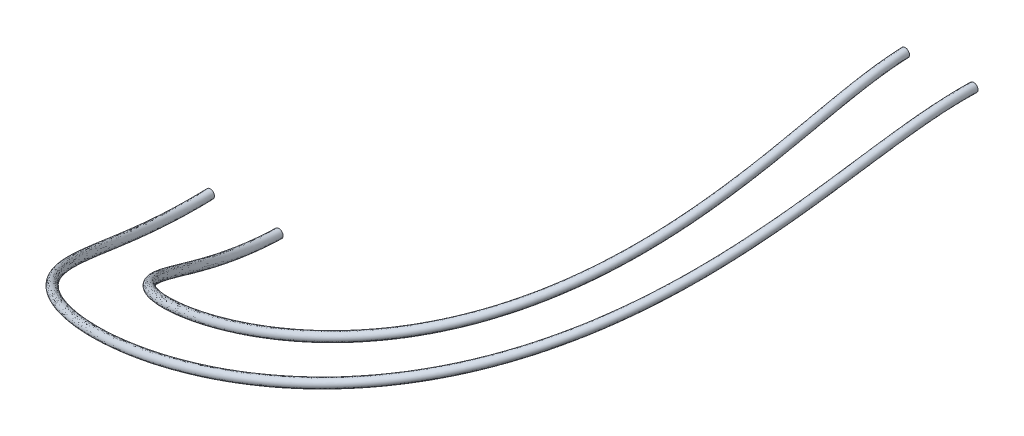
ISO-10303-21;
HEADER;
FILE_DESCRIPTION(('STEP AP214'),'2;1');
FILE_NAME('part.step','',(''),(''),'','','');
FILE_SCHEMA(('AUTOMOTIVE_DESIGN { 1 0 10303 214 1 1 1 1 }'));
ENDSEC;
DATA;
#1=APPLICATION_CONTEXT('core data for automotive mechanical design processes');
#2=APPLICATION_PROTOCOL_DEFINITION('international standard','automotive_design',2000,#1);
#3=PRODUCT_CONTEXT('',#1,'mechanical');
#4=PRODUCT('Part','Part','',(#3));
#5=PRODUCT_RELATED_PRODUCT_CATEGORY('part','',(#4));
#6=PRODUCT_DEFINITION_FORMATION('','',#4);
#7=PRODUCT_DEFINITION_CONTEXT('part definition',#1,'design');
#8=PRODUCT_DEFINITION('design','',#6,#7);
#9=PRODUCT_DEFINITION_SHAPE('','',#8);
#10=(LENGTH_UNIT() NAMED_UNIT(*) SI_UNIT(.MILLI.,.METRE.));
#11=(NAMED_UNIT(*) PLANE_ANGLE_UNIT() SI_UNIT($,.RADIAN.));
#12=(NAMED_UNIT(*) SI_UNIT($,.STERADIAN.) SOLID_ANGLE_UNIT());
#13=UNCERTAINTY_MEASURE_WITH_UNIT(LENGTH_MEASURE(1.E-05),#10,'distance_accuracy_value','');
#14=(GEOMETRIC_REPRESENTATION_CONTEXT(3) GLOBAL_UNCERTAINTY_ASSIGNED_CONTEXT((#13)) GLOBAL_UNIT_ASSIGNED_CONTEXT((#10,
#11,#12)) REPRESENTATION_CONTEXT('',''));
#15=CARTESIAN_POINT('',(0.,0.,0.));
#16=DIRECTION('',(0.,0.,1.));
#17=DIRECTION('',(1.,0.,0.));
#18=AXIS2_PLACEMENT_3D('',#15,#16,#17);
#19=CARTESIAN_POINT('',(-4.,0.,0.));
#20=DIRECTION('',(0.,0.,1.));
#21=DIRECTION('',(1.,0.,0.));
#22=AXIS2_PLACEMENT_3D('',#19,#20,#21);
#23=PLANE('',#22);
#24=CARTESIAN_POINT('',(-4.,0.,0.));
#25=DIRECTION('',(0.,0.,1.));
#26=DIRECTION('',(1.,0.,0.));
#27=AXIS2_PLACEMENT_3D('',#24,#25,#26);
#28=CIRCLE('',#27,0.499999999999999);
#29=CARTESIAN_POINT('',(-3.5,0.,0.));
#30=VERTEX_POINT('',#29);
#31=EDGE_CURVE('E50',#30,#30,#28,.T.);
#32=ORIENTED_EDGE('',*,*,#31,.F.);
#33=EDGE_LOOP('',(#32));
#34=FACE_BOUND('',#33,.T.);
#35=ADVANCED_FACE('F43',(#34),#23,.F.);
#36=CARTESIAN_POINT('',(84.9931572053057,55.2338707628478,0.));
#37=DIRECTION('',(0.,0.,-1.));
#38=DIRECTION('',(-0.998289301326429,-0.0584676907119732,0.));
#39=AXIS2_PLACEMENT_3D('',#36,#37,#38);
#40=PLANE('',#39);
#41=CARTESIAN_POINT('',(84.9931572053057,55.2338707628478,0.));
#42=DIRECTION('',(0.,0.,-1.));
#43=DIRECTION('',(-0.998289301326429,-0.0584676907119732,0.));
#44=AXIS2_PLACEMENT_3D('',#41,#42,#43);
#45=CIRCLE('',#44,0.499999999999999);
#46=CARTESIAN_POINT('',(84.4940125546425,55.2046369174919,0.));
#47=VERTEX_POINT('',#46);
#48=EDGE_CURVE('E12',#47,#47,#45,.T.);
#49=ORIENTED_EDGE('',*,*,#48,.T.);
#50=EDGE_LOOP('',(#49));
#51=FACE_BOUND('',#50,.T.);
#52=ADVANCED_FACE('F57',(#51),#40,.T.);
#53=CARTESIAN_POINT('',(-3.5,0.,0.));
#54=CARTESIAN_POINT('',(-3.49999999960306,-0.0852666043593175,3.20354830547784));
#55=CARTESIAN_POINT('',(-3.14608578982237,0.456625685051473,6.32676211554279));
#56=CARTESIAN_POINT('',(-1.86526629638429,2.27619943484814,12.2527135788759));
#57=CARTESIAN_POINT('',(-0.964403903380054,3.49455464503192,14.9814927504767));
#58=CARTESIAN_POINT('',(1.28618136189157,6.11904635921444,20.1520411026224));
#59=CARTESIAN_POINT('',(2.64748717350486,7.53763644035619,22.5980646617234));
#60=CARTESIAN_POINT('',(5.75447247111704,10.3193784854048,27.1346753180361));
#61=CARTESIAN_POINT('',(7.5131456786479,11.7015238533345,29.2520049731368));
#62=CARTESIAN_POINT('',(11.4804383604942,14.3976308293845,33.1915931376013));
#63=CARTESIAN_POINT('',(13.6908899277374,15.7082031691613,35.0045237855368));
#64=CARTESIAN_POINT('',(18.4096089806881,18.1600679895695,38.1581087427702));
#65=CARTESIAN_POINT('',(20.9318817457448,19.3140080568053,39.5164761204136));
#66=CARTESIAN_POINT('',(26.3161822760704,21.5362955605888,41.7525243335477));
#67=CARTESIAN_POINT('',(29.1698566910031,22.5985411340291,42.6172663898972));
#68=CARTESIAN_POINT('',(34.9419373731698,24.6235788623491,43.7460892807911));
#69=CARTESIAN_POINT('',(37.8810108547779,25.5966263706125,44.0225968492624));
#70=CARTESIAN_POINT('',(43.8394260301558,27.5774567093647,43.9739235405984));
#71=CARTESIAN_POINT('',(46.8091750914019,28.5688556144285,43.6439677265944));
#72=CARTESIAN_POINT('',(52.5507205104943,30.6129472382571,42.4191672510293));
#73=CARTESIAN_POINT('',(55.3496298601686,31.6759704437518,41.5213386677893));
#74=CARTESIAN_POINT('',(60.7115080693986,33.9598668739049,39.1920766245331));
#75=CARTESIAN_POINT('',(63.2104256610736,35.1515237588691,37.7910920907286));
#76=CARTESIAN_POINT('',(67.8500737242992,37.6925875831754,34.5812811167928));
#77=CARTESIAN_POINT('',(70.0052900821006,39.0548060409907,32.7558254811207));
#78=CARTESIAN_POINT('',(73.8636609315842,41.8921894830693,28.8141710977475));
#79=CARTESIAN_POINT('',(75.5653054341556,43.3617554720348,26.7089570506839));
#80=CARTESIAN_POINT('',(78.5566394553984,46.3643263233496,22.2354577611879));
#81=CARTESIAN_POINT('',(79.8554595126248,47.9147417391608,19.8472901688212));
#82=CARTESIAN_POINT('',(82.0017363824807,50.8607387506673,14.834942657744));
#83=CARTESIAN_POINT('',(82.871530894652,52.2935246605702,12.1758165154445));
#84=CARTESIAN_POINT('',(83.8067946248465,53.9687819445732,7.84406206386353));
#85=CARTESIAN_POINT('',(84.0541715612514,54.439163461004,6.35122654450919));
#86=CARTESIAN_POINT('',(84.3977119178899,55.0822082783358,3.2407445355897));
#87=CARTESIAN_POINT('',(84.4915198833983,55.2471972861526,1.62136825458537));
#88=CARTESIAN_POINT('',(84.4940125546425,55.2046369174918,0.));
#89=CARTESIAN_POINT('',(-3.5,0.999999999999998,0.));
#90=CARTESIAN_POINT('',(-3.52436188718587,0.914733395453416,3.07409289425545));
#91=CARTESIAN_POINT('',(-3.20987606275515,1.42961607676719,6.09171629850952));
#92=CARTESIAN_POINT('',(-2.00597132366461,3.20130360311458,11.891589358456));
#93=CARTESIAN_POINT('',(-1.14274127566604,4.39885907260623,14.5923121785157));
#94=CARTESIAN_POINT('',(1.04853502416881,7.00320339940145,19.7485280822413));
#95=CARTESIAN_POINT('',(2.38359254129955,8.41639236322336,22.1996362208435));
#96=CARTESIAN_POINT('',(5.45259807895169,11.199317295012,26.7670109126959));
#97=CARTESIAN_POINT('',(7.19591135209459,12.5844430056154,28.9047909573966));
#98=CARTESIAN_POINT('',(11.1442291732613,15.2916466948463,32.8942037737271));
#99=CARTESIAN_POINT('',(13.3483558982451,16.6082961936529,34.73374340032));
#100=CARTESIAN_POINT('',(18.0624824827251,19.0732959870631,37.9428487715384));
#101=CARTESIAN_POINT('',(20.5841008723534,20.2329630995529,39.3285169712477));
#102=CARTESIAN_POINT('',(25.971400582289,22.4657766523926,41.6185503420842));
#103=CARTESIAN_POINT('',(28.8266544988249,23.5318888581059,42.5090321292503));
#104=CARTESIAN_POINT('',(34.6017183953094,25.562474756739,43.6880727145117));
#105=CARTESIAN_POINT('',(37.5409775431659,26.5367476427261,43.9887648002152));
#106=CARTESIAN_POINT('',(43.4971042595876,28.517237953193,43.9888327891551));
#107=CARTESIAN_POINT('',(46.4642688096571,29.5070306752934,43.6833754913193));
#108=CARTESIAN_POINT('',(52.1982713286301,31.5447269771294,42.5100069596555));
#109=CARTESIAN_POINT('',(54.9929812954372,32.6032463970775,41.6388971018637));
#110=CARTESIAN_POINT('',(60.3465858787826,34.8749168189137,39.3663587793991));
#111=CARTESIAN_POINT('',(62.8430889869222,36.0596143846992,37.994583269667));
#112=CARTESIAN_POINT('',(67.4813211319241,38.584462310002,34.8450129263088));
#113=CARTESIAN_POINT('',(69.6396079822272,39.9386523904354,33.049097870778));
#114=CARTESIAN_POINT('',(73.5102733317813,42.760101097825,29.1645467500104));
#115=CARTESIAN_POINT('',(75.2237470052125,44.2238947011512,27.0841099112476));
#116=CARTESIAN_POINT('',(78.245696453419,47.2188125490871,22.6524153287791));
#117=CARTESIAN_POINT('',(79.5670796788767,48.7715748765746,20.2755399199565));
#118=CARTESIAN_POINT('',(81.7651153417063,51.7320700002247,15.26565852487));
#119=CARTESIAN_POINT('',(82.6700695608569,53.1862657525964,12.5859671111854));
#120=CARTESIAN_POINT('',(83.6615730777604,54.9054409665924,8.16504448372457));
#121=CARTESIAN_POINT('',(83.9292199215955,55.3941329362921,6.62815008228552));
#122=CARTESIAN_POINT('',(84.3102912912648,56.0682971416677,3.39647622612838));
#123=CARTESIAN_POINT('',(84.4208920867413,56.2447743955561,1.70434168051098));
#124=CARTESIAN_POINT('',(84.4355448639305,56.2029262188183,0.));
#125=CARTESIAN_POINT('',(-4.5,0.999999999999998,0.));
#126=CARTESIAN_POINT('',(-4.52436188719996,0.89037150793921,3.14643133206991));
#127=CARTESIAN_POINT('',(-4.20022588425589,1.39639079548639,6.24390985646462));
#128=CARTESIAN_POINT('',(-2.96465305830568,3.16369021436948,12.1824058184377));
#129=CARTESIAN_POINT('',(-2.07917374985641,4.36553970671067,14.947085388463));
#130=CARTESIAN_POINT('',(0.163084341675008,6.97752246247628,20.2167133935194));
#131=CARTESIAN_POINT('',(1.5288497229673,8.39657126526582,22.7217713097565));
#132=CARTESIAN_POINT('',(4.66612254667263,11.1888721560879,27.387454609041));
#133=CARTESIAN_POINT('',(6.44801812083772,12.5786744806578,29.5714519101413));
#134=CARTESIAN_POINT('',(10.483809832563,15.2946804102549,33.6476302198736));
#135=CARTESIAN_POINT('',(12.7363925341692,16.6150880200745,35.5271733622106));
#136=CARTESIAN_POINT('',(17.5563189685909,19.0856923648035,38.8075575544594));
#137=CARTESIAN_POINT('',(20.134080008089,20.2466568321885,40.223907339497));
#138=CARTESIAN_POINT('',(25.6440240639698,22.4817094802038,42.5656516499268));
#139=CARTESIAN_POINT('',(28.5632540689177,23.5476259034081,43.4759642742323));
#140=CARTESIAN_POINT('',(34.4710829632439,25.5769972957986,44.6817068390126));
#141=CARTESIAN_POINT('',(37.4770198803065,26.5495188160736,44.9889683902004));
#142=CARTESIAN_POINT('',(43.5696675878465,28.5277205451916,44.9884754944936));
#143=CARTESIAN_POINT('',(46.6041772326358,29.5161387428665,44.6757784517591));
#144=CARTESIAN_POINT('',(52.4697774126837,31.5527252056654,43.4747563893061));
#145=CARTESIAN_POINT('',(55.3278207277143,32.6112165426273,42.5834212756549));
#146=CARTESIAN_POINT('',(60.801966846192,34.8854221364143,40.2590091692203));
#147=CARTESIAN_POINT('',(63.3544398135412,36.0721606086459,38.8561437013715));
#148=CARTESIAN_POINT('',(68.0960050993779,38.6034357521882,35.6360420241561));
#149=CARTESIAN_POINT('',(70.3014264760352,39.9619393303009,33.8007886907058));
#150=CARTESIAN_POINT('',(74.2565994709869,42.7934057493027,29.831984565656));
#151=CARTESIAN_POINT('',(76.007308180254,44.2627505194182,27.7068736958575));
#152=CARTESIAN_POINT('',(79.0948551165638,47.2691596569955,23.1812889732042));
#153=CARTESIAN_POINT('',(80.4456380326144,48.8291509373556,20.7534016668484));
#154=CARTESIAN_POINT('',(82.6932382901371,51.8016755319922,15.6361643368293));
#155=CARTESIAN_POINT('',(83.6204820657404,53.2639805836731,12.8954713438243));
#156=CARTESIAN_POINT('',(84.6374524936175,54.9876585568772,8.37041904820339));
#157=CARTESIAN_POINT('',(84.9125758534731,55.4770667117972,6.79507336826764));
#158=CARTESIAN_POINT('',(85.3045652947749,56.14566469888,3.48111470470486));
#159=CARTESIAN_POINT('',(85.4184691964109,56.3154021920545,1.74646561051096));
#160=CARTESIAN_POINT('',(85.433834165257,56.2613939095303,-1.22987760935442E-13));
#161=CARTESIAN_POINT('',(-4.5,0.,0.));
#162=CARTESIAN_POINT('',(-4.49999999961715,-0.109628491873523,3.2758867432923));
#163=CARTESIAN_POINT('',(-4.13643561132374,0.423400403770673,6.47895567349788));
#164=CARTESIAN_POINT('',(-2.82394803102473,2.23858604610304,12.5435300388576));
#165=CARTESIAN_POINT('',(-1.90083637757106,3.46123527913635,15.336265960424));
#166=CARTESIAN_POINT('',(0.400730679398401,6.09336542228928,20.6202264139005));
#167=CARTESIAN_POINT('',(1.79274435517324,7.5178153423974,23.1201997506363));
#168=CARTESIAN_POINT('',(4.96799693883736,10.3089333464819,27.7551190143812));
#169=CARTESIAN_POINT('',(6.76525244739102,11.6957553283769,29.9186659258841));
#170=CARTESIAN_POINT('',(10.8200190197959,14.4006645447931,33.9450195837453));
#171=CARTESIAN_POINT('',(13.0789265636616,15.7149949955829,35.7979537474224));
#172=CARTESIAN_POINT('',(17.9034454665539,18.1724643673099,39.0228175256962));
#173=CARTESIAN_POINT('',(20.4818608814805,19.3277017894409,40.411866488668));
#174=CARTESIAN_POINT('',(25.9888057577511,21.5522283883999,42.6996256413853));
#175=CARTESIAN_POINT('',(28.906456261096,22.6142781793288,43.5841985348791));
#176=CARTESIAN_POINT('',(34.8113019411044,24.6381014014113,44.739723405292));
#177=CARTESIAN_POINT('',(37.8170531919185,25.60939754396,45.0228004392476));
#178=CARTESIAN_POINT('',(43.9119893584147,27.5879393013633,44.973566245937));
#179=CARTESIAN_POINT('',(46.9490835143806,28.5779636820016,44.6363706870342));
#180=CARTESIAN_POINT('',(52.8222265945479,30.620945466793,43.38391668068));
#181=CARTESIAN_POINT('',(55.6844692924507,31.6839405892965,42.4658628415805));
#182=CARTESIAN_POINT('',(61.1668890368029,33.9703721914106,40.0847270143543));
#183=CARTESIAN_POINT('',(63.7217764876925,35.1640699828109,38.652652522433));
#184=CARTESIAN_POINT('',(68.464757691753,37.7115610253666,35.3723102146402));
#185=CARTESIAN_POINT('',(70.6671085759288,39.0780929808511,33.5075163010485));
#186=CARTESIAN_POINT('',(74.6099870707695,41.925494134552,29.4816089133931));
#187=CARTESIAN_POINT('',(76.3488666092072,43.4006112903018,27.3317208352964));
#188=CARTESIAN_POINT('',(79.4057981185331,46.414673431258,22.7643314056106));
#189=CARTESIAN_POINT('',(80.7340178663625,47.9723177999418,20.3251519157106));
#190=CARTESIAN_POINT('',(82.9298593309115,50.9303442824348,15.2054484697059));
#191=CARTESIAN_POINT('',(83.8219433995355,52.3712394916469,12.4853207480834));
#192=CARTESIAN_POINT('',(84.7826740407036,54.050999534858,8.04943662834236));
#193=CARTESIAN_POINT('',(85.037527493129,54.5220972365091,6.51814983049131));
#194=CARTESIAN_POINT('',(85.3919859214,55.159575835548,3.32538301416619));
#195=CARTESIAN_POINT('',(85.4890969930679,55.317825082651,1.66349218458535));
#196=CARTESIAN_POINT('',(85.4923018559689,55.2631046082038,-1.10986740156529E-13));
#197=CARTESIAN_POINT('',(-4.5,-0.999999999999998,0.));
#198=CARTESIAN_POINT('',(-4.47563811203433,-1.10962849168626,3.40534215451469));
#199=CARTESIAN_POINT('',(-4.0726453383916,-0.549589987945041,6.71400149053115));
#200=CARTESIAN_POINT('',(-2.68324300374378,1.3134818778366,12.9046542592775));
#201=CARTESIAN_POINT('',(-1.7224990052857,2.55693085156204,15.7254465323851));
#202=CARTESIAN_POINT('',(0.638377017121793,5.20920838210228,21.0237394342817));
#203=CARTESIAN_POINT('',(2.05663898737917,6.63905941952897,23.5186281915161));
#204=CARTESIAN_POINT('',(5.26987133100209,9.42899453687593,28.1227834197214));
#205=CARTESIAN_POINT('',(7.08248677394433,10.812836176096,30.2658799416268));
#206=CARTESIAN_POINT('',(11.1562282070288,13.5066486793313,34.2424089476171));
#207=CARTESIAN_POINT('',(13.4214605931539,14.8149019710914,36.0687341326341));
#208=CARTESIAN_POINT('',(18.2505719645169,17.2592363698163,39.238077496933));
#209=CARTESIAN_POINT('',(20.829641754872,18.4087467466933,40.5998256378389));
#210=CARTESIAN_POINT('',(26.3335874515325,20.6227472965961,42.8335996328437));
#211=CARTESIAN_POINT('',(29.2496584532742,21.6809304552495,43.6924327955259));
#212=CARTESIAN_POINT('',(35.1515209189649,23.6992055070239,44.7977399715715));
#213=CARTESIAN_POINT('',(38.1570865035306,24.6692762718465,45.0566324882949));
#214=CARTESIAN_POINT('',(44.254311128983,26.648158057535,44.9586569973804));
#215=CARTESIAN_POINT('',(47.2939897961254,27.6397886211367,44.5969629223093));
#216=CARTESIAN_POINT('',(53.1746757764121,29.6891657279207,43.2930769720538));
#217=CARTESIAN_POINT('',(56.0411178571872,30.7566646359657,42.348304407506));
#218=CARTESIAN_POINT('',(61.5318112274139,33.0553222464068,39.9104448594882));
#219=CARTESIAN_POINT('',(64.0891131618439,34.2559793569759,38.4491613434945));
#220=CARTESIAN_POINT('',(68.8335102841282,36.8196862985451,35.1085784051242));
#221=CARTESIAN_POINT('',(71.0327906758225,38.1942466314013,33.2142439113912));
#222=CARTESIAN_POINT('',(74.9633746705522,41.0575825198013,29.1312332611302));
#223=CARTESIAN_POINT('',(76.6904250381604,42.5384720611853,26.9565679747353));
#224=CARTESIAN_POINT('',(79.7167411205025,45.5601872055204,22.3473738380169));
#225=CARTESIAN_POINT('',(81.0223977001107,47.115484662528,19.8969021645727));
#226=CARTESIAN_POINT('',(83.166480371686,50.0590130328774,14.7747326025825));
#227=CARTESIAN_POINT('',(84.0234047333307,51.4784983996207,12.0751701523424));
#228=CARTESIAN_POINT('',(84.9278955877896,53.1143405128388,7.72845420848132));
#229=CARTESIAN_POINT('',(85.1624791327849,53.567127761221,6.24122629271498));
#230=CARTESIAN_POINT('',(85.479406548025,54.1734869722161,3.16965132362751));
#231=CARTESIAN_POINT('',(85.5597247897249,54.3202479732475,1.58051875865974));
#232=CARTESIAN_POINT('',(85.5507695466809,54.2648153068774,0.));
#233=CARTESIAN_POINT('',(-3.5,-0.999999999999998,0.));
#234=CARTESIAN_POINT('',(-3.47563811202025,-1.08526660417205,3.33300371670023));
#235=CARTESIAN_POINT('',(-3.08229551688958,-0.516364706664241,6.56180793257606));
#236=CARTESIAN_POINT('',(-1.72456126910398,1.3510952665817,12.6138377992958));
#237=CARTESIAN_POINT('',(-0.786066531094067,2.5902502174576,15.3706733224378));
#238=CARTESIAN_POINT('',(1.52382769961433,5.23488931902744,20.5555541230036));
#239=CARTESIAN_POINT('',(2.91138180571016,6.65888051748902,22.9964931026032));
#240=CARTESIAN_POINT('',(6.0563468632824,9.43943967579757,27.5023397233762));
#241=CARTESIAN_POINT('',(7.83038000520121,10.8186047010536,29.599218988877));
#242=CARTESIAN_POINT('',(11.8166475477271,13.5036149639227,33.4889825014756));
#243=CARTESIAN_POINT('',(14.0334239572298,14.8081101446698,35.2753041707535));
#244=CARTESIAN_POINT('',(18.756735478651,17.2468399920759,38.373368714002));
#245=CARTESIAN_POINT('',(21.2796626191363,18.3950530140577,39.7044352695795));
#246=CARTESIAN_POINT('',(26.6609639698518,20.606814468785,41.8864983250111));
#247=CARTESIAN_POINT('',(29.5130588831814,21.6651934099523,42.725500650544));
#248=CARTESIAN_POINT('',(35.2821563510303,23.6846829679593,43.8041058470706));
#249=CARTESIAN_POINT('',(38.2210441663899,24.656505098499,44.0564288983096));
#250=CARTESIAN_POINT('',(44.1817478007241,26.6376754655365,43.9590142920418));
#251=CARTESIAN_POINT('',(47.1540813731467,27.6306805535637,43.6045599618695));
#252=CARTESIAN_POINT('',(52.9031696923585,29.6811674993847,42.3283275424032));
#253=CARTESIAN_POINT('',(55.7062784249,30.748694490426,41.4037802337148));
#254=CARTESIAN_POINT('',(61.0764302600146,33.044816928896,39.0177944696671));
#255=CARTESIAN_POINT('',(63.5777623352249,34.2434331330391,37.5876009117901));
#256=CARTESIAN_POINT('',(68.2188263166743,36.8007128563489,34.3175493072768));
#257=CARTESIAN_POINT('',(70.370972181974,38.170959691546,32.4625530914634));
#258=CARTESIAN_POINT('',(74.217048531387,41.0242778683136,28.4637954454846));
#259=CARTESIAN_POINT('',(75.9068638630987,42.4996162429183,26.3338041901203));
#260=CARTESIAN_POINT('',(78.8675824573778,45.5098400976121,21.8185001935967));
#261=CARTESIAN_POINT('',(80.143839346373,47.057908601747,19.4190404176859));
#262=CARTESIAN_POINT('',(82.2383574232551,49.9894075011099,14.4042267906181));
#263=CARTESIAN_POINT('',(83.0729922284472,51.400783568544,11.7656659197036));
#264=CARTESIAN_POINT('',(83.9520161719326,53.032122922554,7.5230796440025));
#265=CARTESIAN_POINT('',(84.1791232009073,53.4841939857159,6.07430300673287));
#266=CARTESIAN_POINT('',(84.485132544515,54.0961194150038,3.08501284505102));
#267=CARTESIAN_POINT('',(84.5621476800553,54.2496201767492,1.53839482865976));
#268=CARTESIAN_POINT('',(84.5524802453545,54.2063476161654,0.));
#269=CARTESIAN_POINT('',(-3.5,0.,0.));
#270=CARTESIAN_POINT('',(-3.49999999960306,-0.0852666043593175,3.20354830547784));
#271=CARTESIAN_POINT('',(-3.14608578982237,0.456625685051473,6.32676211554279));
#272=CARTESIAN_POINT('',(-1.86526629638429,2.27619943484814,12.2527135788759));
#273=CARTESIAN_POINT('',(-0.964403903380054,3.49455464503192,14.9814927504767));
#274=CARTESIAN_POINT('',(1.28618136189157,6.11904635921444,20.1520411026224));
#275=CARTESIAN_POINT('',(2.64748717350486,7.53763644035619,22.5980646617234));
#276=CARTESIAN_POINT('',(5.75447247111704,10.3193784854048,27.1346753180361));
#277=CARTESIAN_POINT('',(7.5131456786479,11.7015238533345,29.2520049731368));
#278=CARTESIAN_POINT('',(11.4804383604942,14.3976308293845,33.1915931376013));
#279=CARTESIAN_POINT('',(13.6908899277374,15.7082031691613,35.0045237855368));
#280=CARTESIAN_POINT('',(18.4096089806881,18.1600679895695,38.1581087427702));
#281=CARTESIAN_POINT('',(20.9318817457448,19.3140080568053,39.5164761204136));
#282=CARTESIAN_POINT('',(26.3161822760704,21.5362955605888,41.7525243335477));
#283=CARTESIAN_POINT('',(29.1698566910031,22.5985411340291,42.6172663898972));
#284=CARTESIAN_POINT('',(34.9419373731698,24.6235788623491,43.7460892807911));
#285=CARTESIAN_POINT('',(37.8810108547779,25.5966263706125,44.0225968492624));
#286=CARTESIAN_POINT('',(43.8394260301558,27.5774567093647,43.9739235405984));
#287=CARTESIAN_POINT('',(46.8091750914019,28.5688556144285,43.6439677265944));
#288=CARTESIAN_POINT('',(52.5507205104943,30.6129472382571,42.4191672510293));
#289=CARTESIAN_POINT('',(55.3496298601686,31.6759704437518,41.5213386677893));
#290=CARTESIAN_POINT('',(60.7115080693986,33.9598668739049,39.1920766245331));
#291=CARTESIAN_POINT('',(63.2104256610736,35.1515237588691,37.7910920907286));
#292=CARTESIAN_POINT('',(67.8500737242992,37.6925875831754,34.5812811167928));
#293=CARTESIAN_POINT('',(70.0052900821006,39.0548060409907,32.7558254811207));
#294=CARTESIAN_POINT('',(73.8636609315842,41.8921894830693,28.8141710977475));
#295=CARTESIAN_POINT('',(75.5653054341556,43.3617554720348,26.7089570506839));
#296=CARTESIAN_POINT('',(78.5566394553984,46.3643263233496,22.2354577611879));
#297=CARTESIAN_POINT('',(79.8554595126248,47.9147417391608,19.8472901688212));
#298=CARTESIAN_POINT('',(82.0017363824807,50.8607387506673,14.834942657744));
#299=CARTESIAN_POINT('',(82.871530894652,52.2935246605702,12.1758165154445));
#300=CARTESIAN_POINT('',(83.8067946248465,53.9687819445732,7.84406206386353));
#301=CARTESIAN_POINT('',(84.0541715612514,54.439163461004,6.35122654450919));
#302=CARTESIAN_POINT('',(84.3977119178899,55.0822082783358,3.2407445355897));
#303=CARTESIAN_POINT('',(84.4915198833983,55.2471972861526,1.62136825458537));
#304=CARTESIAN_POINT('',(84.4940125546425,55.2046369174918,0.));
#305=(BOUNDED_SURFACE() B_SPLINE_SURFACE(3,3,((#53,#54,#55,#56,#57,#58,#59,#60,#61,#62,#63,#64,
#65,#66,#67,#68,#69,#70,#71,#72,#73,#74,#75,#76,#77,#78,#79,#80,#81,#82,#83,#84,#85,#86,#87,
#88),(#89,#90,#91,#92,#93,#94,#95,#96,#97,#98,#99,#100,#101,#102,#103,#104,#105,#106,#107,#108,
#109,#110,#111,#112,#113,#114,#115,#116,#117,#118,#119,#120,#121,#122,#123,#124),(#125,#126,
#127,#128,#129,#130,#131,#132,#133,#134,#135,#136,#137,#138,#139,#140,#141,#142,#143,#144,#145,
#146,#147,#148,#149,#150,#151,#152,#153,#154,#155,#156,#157,#158,#159,#160),(#161,#162,#163,
#164,#165,#166,#167,#168,#169,#170,#171,#172,#173,#174,#175,#176,#177,#178,#179,#180,#181,#182,
#183,#184,#185,#186,#187,#188,#189,#190,#191,#192,#193,#194,#195,#196),(#197,#198,#199,#200,
#201,#202,#203,#204,#205,#206,#207,#208,#209,#210,#211,#212,#213,#214,#215,#216,#217,#218,#219,
#220,#221,#222,#223,#224,#225,#226,#227,#228,#229,#230,#231,#232),(#233,#234,#235,#236,#237,
#238,#239,#240,#241,#242,#243,#244,#245,#246,#247,#248,#249,#250,#251,#252,#253,#254,#255,#256,
#257,#258,#259,#260,#261,#262,#263,#264,#265,#266,#267,#268),(#269,#270,#271,#272,#273,#274,
#275,#276,#277,#278,#279,#280,#281,#282,#283,#284,#285,#286,#287,#288,#289,#290,#291,#292,#293,
#294,#295,#296,#297,#298,#299,#300,#301,#302,#303,#304)),.UNSPECIFIED.,.T.,.F.,
.F.) B_SPLINE_SURFACE_WITH_KNOTS((4,3,4),(4,2,2,2,2,2,2,2,2,2,2,2,2,2,2,2,2,4),(0.,0.5,1.),(0.,
0.0625,0.125,0.187499999999915,0.25,0.312499999999966,0.375,0.4375,0.5,0.5625,0.625,
0.687500000000055,0.75,0.81250000000001,0.875,0.9375,0.96875,1.),
.UNSPECIFIED.) GEOMETRIC_REPRESENTATION_ITEM() RATIONAL_B_SPLINE_SURFACE(((1.,1.,1.,1.,1.,1.,1.,
1.,1.,1.,1.,1.,1.,1.,1.,1.,1.,1.,1.,1.,1.,1.,1.,1.,1.,1.,1.,1.,1.,1.,1.,1.,1.,1.,1.,1.),
(0.333333333333333,0.333333333333333,0.333333333333333,0.333333333333333,0.333333333333333,
0.333333333333333,0.333333333333333,0.333333333333333,0.333333333333333,0.333333333333333,
0.333333333333333,0.333333333333333,0.333333333333333,0.333333333333333,0.333333333333333,
0.333333333333333,0.333333333333333,0.333333333333333,0.333333333333333,0.333333333333333,
0.333333333333333,0.333333333333333,0.333333333333333,0.333333333333333,0.333333333333333,
0.333333333333333,0.333333333333333,0.333333333333333,0.333333333333333,0.333333333333333,
0.333333333333333,0.333333333333333,0.333333333333333,0.333333333333333,0.333333333333333,
0.333333333333333),(0.333333333333333,0.333333333333333,0.333333333333333,0.333333333333333,
0.333333333333333,0.333333333333333,0.333333333333333,0.333333333333333,0.333333333333333,
0.333333333333333,0.333333333333333,0.333333333333333,0.333333333333333,0.333333333333333,
0.333333333333333,0.333333333333333,0.333333333333333,0.333333333333333,0.333333333333333,
0.333333333333333,0.333333333333333,0.333333333333333,0.333333333333333,0.333333333333333,
0.333333333333333,0.333333333333333,0.333333333333333,0.333333333333333,0.333333333333333,
0.333333333333333,0.333333333333333,0.333333333333333,0.333333333333333,0.333333333333333,
0.333333333333333,0.333333333333333),(1.,1.,1.,1.,1.,1.,1.,1.,1.,1.,1.,1.,1.,1.,1.,1.,1.,1.,1.,
1.,1.,1.,1.,1.,1.,1.,1.,1.,1.,1.,1.,1.,1.,1.,1.,1.),(0.333333333333333,0.333333333333333,
0.333333333333333,0.333333333333333,0.333333333333333,0.333333333333333,0.333333333333333,
0.333333333333333,0.333333333333333,0.333333333333333,0.333333333333333,0.333333333333333,
0.333333333333333,0.333333333333333,0.333333333333333,0.333333333333333,0.333333333333333,
0.333333333333333,0.333333333333333,0.333333333333333,0.333333333333333,0.333333333333333,
0.333333333333333,0.333333333333333,0.333333333333333,0.333333333333333,0.333333333333333,
0.333333333333333,0.333333333333333,0.333333333333333,0.333333333333333,0.333333333333333,
0.333333333333333,0.333333333333333,0.333333333333333,0.333333333333333),(0.333333333333333,
0.333333333333333,0.333333333333333,0.333333333333333,0.333333333333333,0.333333333333333,
0.333333333333333,0.333333333333333,0.333333333333333,0.333333333333333,0.333333333333333,
0.333333333333333,0.333333333333333,0.333333333333333,0.333333333333333,0.333333333333333,
0.333333333333333,0.333333333333333,0.333333333333333,0.333333333333333,0.333333333333333,
0.333333333333333,0.333333333333333,0.333333333333333,0.333333333333333,0.333333333333333,
0.333333333333333,0.333333333333333,0.333333333333333,0.333333333333333,0.333333333333333,
0.333333333333333,0.333333333333333,0.333333333333333,0.333333333333333,0.333333333333333),(1.,
1.,1.,1.,1.,1.,1.,1.,1.,1.,1.,1.,1.,1.,1.,1.,1.,1.,1.,1.,1.,1.,1.,1.,1.,1.,1.,1.,1.,1.,1.,1.,1.,
1.,1.,1.))) REPRESENTATION_ITEM('') SURFACE());
#306=ORIENTED_EDGE('',*,*,#48,.F.);
#307=EDGE_LOOP('',(#306));
#308=FACE_BOUND('',#307,.T.);
#309=ORIENTED_EDGE('',*,*,#31,.T.);
#310=EDGE_LOOP('',(#309));
#311=FACE_BOUND('',#310,.T.);
#312=ADVANCED_FACE('F59',(#308,#311),#305,.T.);
#313=CLOSED_SHELL('',(#35,#52,#312));
#314=MANIFOLD_SOLID_BREP('B2',#313);
#315=CARTESIAN_POINT('',(4.,0.,0.));
#316=DIRECTION('',(0.,0.,1.));
#317=DIRECTION('',(1.,0.,0.));
#318=AXIS2_PLACEMENT_3D('',#315,#316,#317);
#319=PLANE('',#318);
#320=CARTESIAN_POINT('',(4.,0.,0.));
#321=DIRECTION('',(0.,0.,1.));
#322=DIRECTION('',(1.,0.,0.));
#323=AXIS2_PLACEMENT_3D('',#320,#321,#322);
#324=CIRCLE('',#323,0.499999999999999);
#325=CARTESIAN_POINT('',(4.5,0.,0.));
#326=VERTEX_POINT('',#325);
#327=EDGE_CURVE('E100',#326,#326,#324,.T.);
#328=ORIENTED_EDGE('',*,*,#327,.F.);
#329=EDGE_LOOP('',(#328));
#330=FACE_BOUND('',#329,.T.);
#331=ADVANCED_FACE('F93',(#330),#319,.F.);
#332=CARTESIAN_POINT('',(77.0068427946943,54.7661292371521,1.37868298383803E-13));
#333=DIRECTION('',(0.,0.,-1.));
#334=DIRECTION('',(-0.998289301326429,-0.0584676907119732,0.));
#335=AXIS2_PLACEMENT_3D('',#332,#333,#334);
#336=PLANE('',#335);
#337=CARTESIAN_POINT('',(77.0068427946943,54.7661292371521,1.37868298383803E-13));
#338=DIRECTION('',(0.,0.,-1.));
#339=DIRECTION('',(-0.998289301326429,-0.0584676907119732,0.));
#340=AXIS2_PLACEMENT_3D('',#337,#338,#339);
#341=CIRCLE('',#340,0.499999999999999);
#342=CARTESIAN_POINT('',(76.5076981440311,54.7368953917961,1.52506830062646E-13));
#343=VERTEX_POINT('',#342);
#344=EDGE_CURVE('E41',#343,#343,#341,.T.);
#345=ORIENTED_EDGE('',*,*,#344,.T.);
#346=EDGE_LOOP('',(#345));
#347=FACE_BOUND('',#346,.T.);
#348=ADVANCED_FACE('F107',(#347),#336,.T.);
#349=CARTESIAN_POINT('',(4.5,0.,0.));
#350=CARTESIAN_POINT('',(4.50000000056211,0.109628495754328,2.62484080296213));
#351=CARTESIAN_POINT('',(4.77671278220076,0.722427935296926,5.10921365188172));
#352=CARTESIAN_POINT('',(5.80418758072716,2.57710654480989,9.92618189904279));
#353=CARTESIAN_POINT('',(6.52705589014481,3.76110957219265,12.1433070709182));
#354=CARTESIAN_POINT('',(8.36978682184011,6.32449385461953,16.4065586123774));
#355=CARTESIAN_POINT('',(9.48542972016036,7.69620522403158,18.4209839504));
#356=CARTESIAN_POINT('',(12.046276729352,10.4029395967829,22.1711257472952));
#357=CARTESIAN_POINT('',(13.4962915287029,11.7476720529953,23.9187173511185));
#358=CARTESIAN_POINT('',(16.7637930860806,14.3733611061157,27.1641815684897));
#359=CARTESIAN_POINT('',(18.5865968403344,15.6538685578236,28.6570840904418));
#360=CARTESIAN_POINT('',(22.4589170937716,18.0608969676115,31.2404384793726));
#361=CARTESIAN_POINT('',(24.5320486598343,19.2044581957204,32.3533531743184));
#362=CARTESIAN_POINT('',(28.9351944226498,21.4088329380997,34.175713870907));
#363=CARTESIAN_POINT('',(31.2770601302301,22.4726447716018,34.8818092300415));
#364=CARTESIAN_POINT('',(35.9870208297235,24.5073985498823,35.7970162847842));
#365=CARTESIAN_POINT('',(38.392672157602,25.4944569838174,36.0209681294313));
#366=CARTESIAN_POINT('',(43.2589194041352,27.4935959733913,35.9767818978392));
#367=CARTESIAN_POINT('',(45.6899077076225,28.4959910738492,35.704744043076));
#368=CARTESIAN_POINT('',(50.3786718380155,30.5489614099643,34.701171813824));
#369=CARTESIAN_POINT('',(52.6709144019621,31.6122092793834,33.965145277429));
#370=CARTESIAN_POINT('',(57.0684603301127,33.8758243338694,32.0508735059944));
#371=CARTESIAN_POINT('',(59.119619048172,35.0511539672747,30.8986086371331));
#372=CARTESIAN_POINT('',(62.9326019846184,37.5408000457061,28.2530483339737));
#373=CARTESIAN_POINT('',(64.7107421315759,38.8685105220769,26.7422989217237));
#374=CARTESIAN_POINT('',(67.8930518180004,41.625752271238,23.4746685725575));
#375=CARTESIAN_POINT('',(69.2968160337429,43.0509089259491,21.7268467737993));
#376=CARTESIAN_POINT('',(71.7633701503207,45.9615494600326,18.0044686057915));
#377=CARTESIAN_POINT('',(72.8269926827025,47.4541332529328,16.0243961937062));
#378=CARTESIAN_POINT('',(74.5767527950543,50.3038944965071,11.870896162049));
#379=CARTESIAN_POINT('',(75.2682308556653,51.6718060119368,9.69978265433347));
#380=CARTESIAN_POINT('',(75.9997592979495,53.3110412223049,6.20106554803299));
#381=CARTESIAN_POINT('',(76.1873241062611,53.7756932569632,5.01584025665071));
#382=CARTESIAN_POINT('',(76.4435198897794,54.4632678206378,2.56363670697939));
#383=CARTESIAN_POINT('',(76.5109030061543,54.6821749142682,1.2843768145855));
#384=CARTESIAN_POINT('',(76.5076981440311,54.7368953917961,1.52506830062646E-13));
#385=CARTESIAN_POINT('',(4.5,0.999999999999999,0.));
#386=CARTESIAN_POINT('',(4.4756381129793,1.10962849556706,2.49538539173974));
#387=CARTESIAN_POINT('',(4.71292250926797,1.6954183270128,4.87416783484845));
#388=CARTESIAN_POINT('',(5.66348255344684,3.50221071307617,9.5650576786229));
#389=CARTESIAN_POINT('',(6.34871851785945,4.66541399976633,11.7541264989572));
#390=CARTESIAN_POINT('',(8.13214048411671,7.20865089480717,16.0030455919963));
#391=CARTESIAN_POINT('',(9.22153508795568,8.57496114689875,18.0225555095227));
#392=CARTESIAN_POINT('',(11.744402337186,11.2828784063902,21.8034613419525));
#393=CARTESIAN_POINT('',(13.1790572021496,12.630591205275,23.5715033353808));
#394=CARTESIAN_POINT('',(16.4275838988477,15.2673769715788,26.8667922046129));
#395=CARTESIAN_POINT('',(18.244062810842,16.5539615823126,28.3863037052275));
#396=CARTESIAN_POINT('',(22.1117905958086,18.9741249651076,31.0251785081384));
#397=CARTESIAN_POINT('',(24.1842677864454,20.123413238468,32.1653940251475));
#398=CARTESIAN_POINT('',(28.5904127288659,22.3383140299036,34.0417398794486));
#399=CARTESIAN_POINT('',(30.9338579380518,23.4059924956811,34.7735749693947));
#400=CARTESIAN_POINT('',(35.6468018518631,25.4462944442697,35.7389997185048));
#401=CARTESIAN_POINT('',(38.05263884599,26.4345782559309,35.9871360803841));
#402=CARTESIAN_POINT('',(42.9165976335669,28.4333772172195,35.9916911463959));
#403=CARTESIAN_POINT('',(45.3450014258777,29.4341661347116,35.7441518078009));
#404=CARTESIAN_POINT('',(50.0262226561513,31.4807411488392,34.7920115224501));
#405=CARTESIAN_POINT('',(52.3142658372257,32.5394852327091,34.0827037115034));
#406=CARTESIAN_POINT('',(56.7035381395018,34.7908742788782,32.2251556608604));
#407=CARTESIAN_POINT('',(58.7522823740156,35.9592445931047,31.1020998160716));
#408=CARTESIAN_POINT('',(62.5638493922483,38.4326747725327,28.5167801434897));
#409=CARTESIAN_POINT('',(64.3450600316823,39.7523568715267,27.035571311381));
#410=CARTESIAN_POINT('',(67.5396642182177,42.4936638859887,23.8250442248204));
#411=CARTESIAN_POINT('',(68.9552576047897,43.9130481550655,22.1019996343604));
#412=CARTESIAN_POINT('',(71.4524271483513,46.8160356857701,18.4214261733852));
#413=CARTESIAN_POINT('',(72.5386128489544,48.3109663903467,16.4526459448428));
#414=CARTESIAN_POINT('',(74.3401317542799,51.1752257460645,12.3016120291737));
#415=CARTESIAN_POINT('',(75.0667695218702,52.564547103963,10.109933250075));
#416=CARTESIAN_POINT('',(75.8545377508634,54.2477002443242,6.52204796789371));
#417=CARTESIAN_POINT('',(76.0623724666052,54.7306627322488,5.29276379442688));
#418=CARTESIAN_POINT('',(76.3560992631543,55.4493566839722,2.71936839751823));
#419=CARTESIAN_POINT('',(76.4402752094973,55.6797520236563,1.36735024051111));
#420=CARTESIAN_POINT('',(76.4492304533191,55.7351846931225,1.40505809283732E-13));
#421=CARTESIAN_POINT('',(3.5,0.999999999999999,0.));
#422=CARTESIAN_POINT('',(3.47563811295882,1.08526660805286,2.5677238295542));
#423=CARTESIAN_POINT('',(3.72257268776596,1.66219304573216,5.02636139280481));
#424=CARTESIAN_POINT('',(4.70480081880704,3.46459732433091,9.85587413860332));
#425=CARTESIAN_POINT('',(5.41228604366908,4.63209463387329,12.108899708902));
#426=CARTESIAN_POINT('',(7.24668980162291,7.18296995787948,16.4712309032769));
#427=CARTESIAN_POINT('',(8.36679226962406,8.5551400489387,18.5446905984356));
#428=CARTESIAN_POINT('',(10.9579268049064,11.2724332674685,22.4239050382976));
#429=CARTESIAN_POINT('',(12.431163970894,12.6248226803186,24.238164288128));
#430=CARTESIAN_POINT('',(15.7671645581481,15.2704106869861,27.6202186507569));
#431=CARTESIAN_POINT('',(17.6320994467686,16.5607534087292,29.1797336671182));
#432=CARTESIAN_POINT('',(21.6056270816719,18.986521342853,31.8898872910593));
#433=CARTESIAN_POINT('',(23.7342469221785,20.1371069711011,33.0607843934069));
#434=CARTESIAN_POINT('',(28.2630362105491,22.3542468577172,34.9888411872811));
#435=CARTESIAN_POINT('',(30.6704575081447,23.4217295409858,35.7405071143766));
#436=CARTESIAN_POINT('',(35.5161664197976,25.4608169833268,36.7326338430056));
#437=CARTESIAN_POINT('',(37.9886811831458,26.4473494292809,36.9873396703693));
#438=CARTESIAN_POINT('',(42.9891609618107,28.4438598092156,36.9913338517344));
#439=CARTESIAN_POINT('',(45.4849098488463,29.4432742022846,36.7365547682407));
#440=CARTESIAN_POINT('',(50.2977287402149,31.4887393773752,35.7567609521008));
#441=CARTESIAN_POINT('',(52.6491052694977,32.5474553782589,35.0272278852947));
#442=CARTESIAN_POINT('',(57.1589191069163,34.8013795963789,33.1178060506815));
#443=CARTESIAN_POINT('',(59.2636332006195,35.9717908170566,31.9636602477685));
#444=CARTESIAN_POINT('',(63.1785333597171,38.4516482147138,29.3078092413446));
#445=CARTESIAN_POINT('',(65.0068785255004,39.7756438113972,27.7872621313088));
#446=CARTESIAN_POINT('',(68.2859903574132,42.5269685374613,24.492482040466));
#447=CARTESIAN_POINT('',(69.7388187798413,43.9519039733325,22.7247634189729));
#448=CARTESIAN_POINT('',(72.301585811486,46.8663827936784,18.9502998178079));
#449=CARTESIAN_POINT('',(73.4171712026921,48.3685424511277,16.930507691736));
#450=CARTESIAN_POINT('',(75.2682547027107,51.244831277832,12.6721178411318));
#451=CARTESIAN_POINT('',(76.0171820267537,52.6422619350346,10.4194374827139));
#452=CARTESIAN_POINT('',(76.8304171667205,54.3299178346115,6.72742253237253));
#453=CARTESIAN_POINT('',(77.0457283984828,54.8135965077539,5.45968708040915));
#454=CARTESIAN_POINT('',(77.3503732666643,55.5267242411845,2.80400687609456));
#455=CARTESIAN_POINT('',(77.4378523191669,55.750379820147,1.40947417051109));
#456=CARTESIAN_POINT('',(77.4475197546455,55.7936523838345,1.11228745926046E-13));
#457=CARTESIAN_POINT('',(3.5,0.,0.));
#458=CARTESIAN_POINT('',(3.50000000054163,0.0852666082401228,2.69717924077659));
#459=CARTESIAN_POINT('',(3.78636296069874,0.689202654016126,5.26140720983808));
#460=CARTESIAN_POINT('',(4.84550584608735,2.53949315606479,10.2169983590232));
#461=CARTESIAN_POINT('',(5.59062341595444,3.72779020629835,12.498080280863));
#462=CARTESIAN_POINT('',(7.48433613934631,6.29881291769311,16.874743923658));
#463=CARTESIAN_POINT('',(8.63068690182999,7.67638412607278,18.9431190393129));
#464=CARTESIAN_POINT('',(11.2598011970711,10.39249445786,22.7915694436403));
#465=CARTESIAN_POINT('',(12.7483982974461,11.7419035280377,24.5853783038657));
#466=CARTESIAN_POINT('',(16.1033737453823,14.3763948215243,27.9176080146337));
#467=CARTESIAN_POINT('',(17.974633476261,15.6606603842402,29.4505140523324));
#468=CARTESIAN_POINT('',(21.9527535796349,18.0732933453569,32.1051472622936));
#469=CARTESIAN_POINT('',(24.08202779557,19.218151928356,33.2487435425728));
#470=CARTESIAN_POINT('',(28.6078179043305,21.4247657659109,35.1228151787446));
#471=CARTESIAN_POINT('',(31.013659700323,22.4883818169065,35.8487413750235));
#472=CARTESIAN_POINT('',(35.8563853976581,24.5219210889394,36.7906504092851));
#473=CARTESIAN_POINT('',(38.3287144947528,25.5072281571648,37.0211717194165));
#474=CARTESIAN_POINT('',(43.331482732384,27.5040785653898,36.9764246031778));
#475=CARTESIAN_POINT('',(45.8298161305912,28.5050991414222,36.6971470035158));
#476=CARTESIAN_POINT('',(50.6501779220791,30.5569596385003,35.6659212434746));
#477=CARTESIAN_POINT('',(53.0057538342341,31.6201794249282,34.9096694512202));
#478=CARTESIAN_POINT('',(57.5238412975272,33.8863296513751,32.9435238958155));
#479=CARTESIAN_POINT('',(59.6309698747809,35.0637001912265,31.7601690688325));
#480=CARTESIAN_POINT('',(63.5472859520822,37.5597734878873,29.0440774318261));
#481=CARTESIAN_POINT('',(65.3725606253839,38.8917974619474,27.4939897416515));
#482=CARTESIAN_POINT('',(68.6393779572059,41.6590569227106,24.1421063882031));
#483=CARTESIAN_POINT('',(70.0803772087945,43.0897647442161,22.3496105584117));
#484=CARTESIAN_POINT('',(72.6125288134554,46.0118965679409,18.5333422502142));
#485=CARTESIAN_POINT('',(73.7055510364403,47.5117093137139,16.5022579405981));
#486=CARTESIAN_POINT('',(75.5048757434851,50.3735000282746,12.2414019740084));
#487=CARTESIAN_POINT('',(76.2186433605488,51.7495208430135,10.0092868869723));
#488=CARTESIAN_POINT('',(76.9756387138066,53.3932588125897,6.40644011251181));
#489=CARTESIAN_POINT('',(77.1706800381387,53.8586270324683,5.18276354263313));
#490=CARTESIAN_POINT('',(77.4377938932894,54.54063537785,2.64827518555556));
#491=CARTESIAN_POINT('',(77.5084801158239,54.752802710741,1.32650074458548));
#492=CARTESIAN_POINT('',(77.5059874453575,54.795363082508,1.2322976670496E-13));
#493=CARTESIAN_POINT('',(3.5,-0.999999999999996,0.));
#494=CARTESIAN_POINT('',(3.52436188812444,-0.91473339157261,2.82663465199898));
#495=CARTESIAN_POINT('',(3.85015323363153,-0.283787737699906,5.49645302687135));
#496=CARTESIAN_POINT('',(4.98621087336767,1.61438898779867,10.5781225794431));
#497=CARTESIAN_POINT('',(5.7689607882398,2.8234857787234,12.8872608528241));
#498=CARTESIAN_POINT('',(7.7219824770697,5.41465587750674,17.2782569440392));
#499=CARTESIAN_POINT('',(8.89458153403593,6.79762820320686,19.3415474801902));
#500=CARTESIAN_POINT('',(11.5616755892358,9.51255564825158,23.159233848983));
#501=CARTESIAN_POINT('',(13.0656326239981,10.8589843757568,24.9325923196034));
#502=CARTESIAN_POINT('',(16.4395829326164,13.4823789560625,28.2149973785105));
#503=CARTESIAN_POINT('',(18.3171675057534,14.7605673597511,29.7212944375467));
#504=CARTESIAN_POINT('',(22.2998800775979,17.1600653478608,32.3204072335279));
#505=CARTESIAN_POINT('',(24.4298086689615,18.2991968856109,33.4367026917387));
#506=CARTESIAN_POINT('',(28.9525995981119,20.4952846741045,35.2567891702081));
#507=CARTESIAN_POINT('',(31.3568618925012,21.5550340928271,35.9569756356703));
#508=CARTESIAN_POINT('',(36.1966043755186,23.583025194552,36.8486669755645));
#509=CARTESIAN_POINT('',(38.6687478063597,24.5671068850488,37.0550037684638));
#510=CARTESIAN_POINT('',(43.6738045029573,26.5642973215641,36.9615153546211));
#511=CARTESIAN_POINT('',(46.174722412336,27.5669240805599,36.6577392387909));
#512=CARTESIAN_POINT('',(51.0026271039433,29.6251798996254,35.5750815348485));
#513=CARTESIAN_POINT('',(53.3624023989706,30.6929034715974,34.7921110171458));
#514=CARTESIAN_POINT('',(57.8887634881382,32.9712797063713,32.7692417409495));
#515=CARTESIAN_POINT('',(59.9983065489423,34.1556095653965,31.5566778898966));
#516=CARTESIAN_POINT('',(63.9160385444473,36.6678987610607,28.7803456223076));
#517=CARTESIAN_POINT('',(65.7382427252674,38.0079511124977,27.2007173519942));
#518=CARTESIAN_POINT('',(68.9927655569987,40.7911453079599,23.7917307359401));
#519=CARTESIAN_POINT('',(70.4219356377477,42.2276255150997,21.9744576978506));
#520=CARTESIAN_POINT('',(72.9234718154247,45.1574103422034,18.1163846826205));
#521=CARTESIAN_POINT('',(73.9939308701884,46.6548761763,16.0740081894603));
#522=CARTESIAN_POINT('',(75.7414967842595,49.5021687787172,11.810686106885));
#523=CARTESIAN_POINT('',(76.4201046943439,50.8567797509923,9.59913629123078));
#524=CARTESIAN_POINT('',(77.1208602608926,52.456599790568,6.08545769265109));
#525=CARTESIAN_POINT('',(77.2956316777945,52.9036575571828,4.90584000485712));
#526=CARTESIAN_POINT('',(77.5252145199145,53.5545465145156,2.49254349501657));
#527=CARTESIAN_POINT('',(77.5791079124809,53.7552256013349,1.24352731865987));
#528=CARTESIAN_POINT('',(77.5644551360695,53.7970737811816,1.35230787483873E-13));
#529=CARTESIAN_POINT('',(4.5,-0.999999999999996,0.));
#530=CARTESIAN_POINT('',(4.52436188814492,-0.890371504058405,2.75429621418451));
#531=CARTESIAN_POINT('',(4.84050305513354,-0.250562456418947,5.34425946891498));
#532=CARTESIAN_POINT('',(5.94489260800747,1.65200237654361,10.2873061194627));
#533=CARTESIAN_POINT('',(6.70539326243017,2.85680514461896,12.5324876428793));
#534=CARTESIAN_POINT('',(8.6074331595635,5.4403368144319,16.8100716327585));
#535=CARTESIAN_POINT('',(9.74932435236504,6.81744930116441,18.8194123912773));
#536=CARTESIAN_POINT('',(12.348151121518,9.52300078717573,22.5387901526379));
#537=CARTESIAN_POINT('',(13.8135258552562,10.8647529007157,24.2659313668562));
#538=CARTESIAN_POINT('',(17.1000022733135,13.4793452406526,27.4615709323665));
#539=CARTESIAN_POINT('',(18.9291308698267,14.7537755333345,28.9278644756561));
#540=CARTESIAN_POINT('',(22.8060435917346,17.1476689701154,31.4556984506069));
#541=CARTESIAN_POINT('',(24.8798295332233,18.2855031529728,32.5413123234894));
#542=CARTESIAN_POINT('',(29.2799761164337,20.4793518462959,34.3096878623654));
#543=CARTESIAN_POINT('',(31.6202623224084,21.5392970475225,34.9900434906884));
#544=CARTESIAN_POINT('',(36.327239807584,23.5685026554949,35.8550328510637));
#545=CARTESIAN_POINT('',(38.732705469214,24.5543357117038,36.0548001784786));
#546=CARTESIAN_POINT('',(43.6012411747035,26.553814729563,35.9618726492826));
#547=CARTESIAN_POINT('',(46.0348139893673,27.5578160129868,35.6653362783511));
#548=CARTESIAN_POINT('',(50.7311210198797,29.6171816710895,34.6103321051978));
#549=CARTESIAN_POINT('',(53.0275629666986,30.6849333260577,33.8475868433545));
#550=CARTESIAN_POINT('',(57.4333825207236,32.9607743888605,31.8765913511283));
#551=CARTESIAN_POINT('',(59.4869557223284,34.1430633414447,30.6951174581946));
#552=CARTESIAN_POINT('',(63.3013545769885,36.6489253188795,27.9893165244578));
#553=CARTESIAN_POINT('',(65.0764242314695,37.9846641726271,26.4490265320664));
#554=CARTESIAN_POINT('',(68.246439417783,40.7578406564873,23.1242929202945));
#555=CARTESIAN_POINT('',(69.6383744626961,42.1887696968327,21.3516939132382));
#556=CARTESIAN_POINT('',(72.07431315229,45.1070632342951,17.5875110381978));
#557=CARTESIAN_POINT('',(73.1153725164507,46.597300115519,15.5961464425696));
#558=CARTESIAN_POINT('',(74.8133738358287,49.4325632469497,11.4401802949244));
#559=CARTESIAN_POINT('',(75.4696921894604,50.7790649199106,9.2896320585919));
#560=CARTESIAN_POINT('',(76.1449808450356,52.3743822002857,5.88008312817227));
#561=CARTESIAN_POINT('',(76.3122757459169,52.8207237816777,4.73891671887454));
#562=CARTESIAN_POINT('',(76.5309405164045,53.4771789573033,2.40790501644056));
#563=CARTESIAN_POINT('',(76.5815308028113,53.6845978048801,1.20140338865989));
#564=CARTESIAN_POINT('',(76.5661658347431,53.7386060904696,1.64507850841559E-13));
#565=CARTESIAN_POINT('',(4.5,0.,0.));
#566=CARTESIAN_POINT('',(4.50000000056211,0.109628495754328,2.62484080296213));
#567=CARTESIAN_POINT('',(4.77671278220076,0.722427935296926,5.10921365188172));
#568=CARTESIAN_POINT('',(5.80418758072716,2.57710654480989,9.92618189904279));
#569=CARTESIAN_POINT('',(6.52705589014481,3.76110957219265,12.1433070709182));
#570=CARTESIAN_POINT('',(8.36978682184011,6.32449385461953,16.4065586123774));
#571=CARTESIAN_POINT('',(9.48542972016036,7.69620522403158,18.4209839504));
#572=CARTESIAN_POINT('',(12.046276729352,10.4029395967829,22.1711257472952));
#573=CARTESIAN_POINT('',(13.4962915287029,11.7476720529953,23.9187173511185));
#574=CARTESIAN_POINT('',(16.7637930860806,14.3733611061157,27.1641815684897));
#575=CARTESIAN_POINT('',(18.5865968403344,15.6538685578236,28.6570840904418));
#576=CARTESIAN_POINT('',(22.4589170937716,18.0608969676115,31.2404384793726));
#577=CARTESIAN_POINT('',(24.5320486598343,19.2044581957204,32.3533531743184));
#578=CARTESIAN_POINT('',(28.9351944226498,21.4088329380997,34.175713870907));
#579=CARTESIAN_POINT('',(31.2770601302301,22.4726447716018,34.8818092300415));
#580=CARTESIAN_POINT('',(35.9870208297235,24.5073985498823,35.7970162847842));
#581=CARTESIAN_POINT('',(38.392672157602,25.4944569838174,36.0209681294313));
#582=CARTESIAN_POINT('',(43.2589194041352,27.4935959733913,35.9767818978392));
#583=CARTESIAN_POINT('',(45.6899077076225,28.4959910738492,35.704744043076));
#584=CARTESIAN_POINT('',(50.3786718380155,30.5489614099643,34.701171813824));
#585=CARTESIAN_POINT('',(52.6709144019621,31.6122092793834,33.965145277429));
#586=CARTESIAN_POINT('',(57.0684603301127,33.8758243338694,32.0508735059944));
#587=CARTESIAN_POINT('',(59.119619048172,35.0511539672747,30.8986086371331));
#588=CARTESIAN_POINT('',(62.9326019846184,37.5408000457061,28.2530483339737));
#589=CARTESIAN_POINT('',(64.7107421315759,38.8685105220769,26.7422989217237));
#590=CARTESIAN_POINT('',(67.8930518180004,41.625752271238,23.4746685725575));
#591=CARTESIAN_POINT('',(69.2968160337429,43.0509089259491,21.7268467737993));
#592=CARTESIAN_POINT('',(71.7633701503207,45.9615494600326,18.0044686057915));
#593=CARTESIAN_POINT('',(72.8269926827025,47.4541332529328,16.0243961937062));
#594=CARTESIAN_POINT('',(74.5767527950543,50.3038944965071,11.870896162049));
#595=CARTESIAN_POINT('',(75.2682308556653,51.6718060119368,9.69978265433347));
#596=CARTESIAN_POINT('',(75.9997592979495,53.3110412223049,6.20106554803299));
#597=CARTESIAN_POINT('',(76.1873241062611,53.7756932569632,5.01584025665071));
#598=CARTESIAN_POINT('',(76.4435198897794,54.4632678206378,2.56363670697939));
#599=CARTESIAN_POINT('',(76.5109030061543,54.6821749142682,1.2843768145855));
#600=CARTESIAN_POINT('',(76.5076981440311,54.7368953917961,1.52506830062646E-13));
#601=(BOUNDED_SURFACE() B_SPLINE_SURFACE(3,3,((#349,#350,#351,#352,#353,#354,#355,#356,#357,
#358,#359,#360,#361,#362,#363,#364,#365,#366,#367,#368,#369,#370,#371,#372,#373,#374,#375,#376,
#377,#378,#379,#380,#381,#382,#383,#384),(#385,#386,#387,#388,#389,#390,#391,#392,#393,#394,
#395,#396,#397,#398,#399,#400,#401,#402,#403,#404,#405,#406,#407,#408,#409,#410,#411,#412,#413,
#414,#415,#416,#417,#418,#419,#420),(#421,#422,#423,#424,#425,#426,#427,#428,#429,#430,#431,
#432,#433,#434,#435,#436,#437,#438,#439,#440,#441,#442,#443,#444,#445,#446,#447,#448,#449,#450,
#451,#452,#453,#454,#455,#456),(#457,#458,#459,#460,#461,#462,#463,#464,#465,#466,#467,#468,
#469,#470,#471,#472,#473,#474,#475,#476,#477,#478,#479,#480,#481,#482,#483,#484,#485,#486,#487,
#488,#489,#490,#491,#492),(#493,#494,#495,#496,#497,#498,#499,#500,#501,#502,#503,#504,#505,
#506,#507,#508,#509,#510,#511,#512,#513,#514,#515,#516,#517,#518,#519,#520,#521,#522,#523,#524,
#525,#526,#527,#528),(#529,#530,#531,#532,#533,#534,#535,#536,#537,#538,#539,#540,#541,#542,
#543,#544,#545,#546,#547,#548,#549,#550,#551,#552,#553,#554,#555,#556,#557,#558,#559,#560,#561,
#562,#563,#564),(#565,#566,#567,#568,#569,#570,#571,#572,#573,#574,#575,#576,#577,#578,#579,
#580,#581,#582,#583,#584,#585,#586,#587,#588,#589,#590,#591,#592,#593,#594,#595,#596,#597,#598,
#599,#600)),.UNSPECIFIED.,.T.,.F.,.F.) B_SPLINE_SURFACE_WITH_KNOTS((4,3,4),(4,2,2,2,2,2,2,2,2,2,
2,2,2,2,2,2,2,4),(0.,0.5,1.),(0.,0.0625,0.125,0.187499999999915,0.25,0.312499999999966,0.375,
0.4375,0.5,0.5625,0.625,0.687500000000055,0.75,0.81250000000001,0.875,0.9375,0.96875,1.),
.UNSPECIFIED.) GEOMETRIC_REPRESENTATION_ITEM() RATIONAL_B_SPLINE_SURFACE(((1.,1.,1.,1.,1.,1.,1.,
1.,1.,1.,1.,1.,1.,1.,1.,1.,1.,1.,1.,1.,1.,1.,1.,1.,1.,1.,1.,1.,1.,1.,1.,1.,1.,1.,1.,1.),
(0.333333333333333,0.333333333333333,0.333333333333333,0.333333333333333,0.333333333333333,
0.333333333333333,0.333333333333333,0.333333333333333,0.333333333333333,0.333333333333333,
0.333333333333333,0.333333333333333,0.333333333333333,0.333333333333333,0.333333333333333,
0.333333333333333,0.333333333333333,0.333333333333333,0.333333333333333,0.333333333333333,
0.333333333333333,0.333333333333333,0.333333333333333,0.333333333333333,0.333333333333333,
0.333333333333333,0.333333333333333,0.333333333333333,0.333333333333333,0.333333333333333,
0.333333333333333,0.333333333333333,0.333333333333333,0.333333333333333,0.333333333333333,
0.333333333333333),(0.333333333333333,0.333333333333333,0.333333333333333,0.333333333333333,
0.333333333333333,0.333333333333333,0.333333333333333,0.333333333333333,0.333333333333333,
0.333333333333333,0.333333333333333,0.333333333333333,0.333333333333333,0.333333333333333,
0.333333333333333,0.333333333333333,0.333333333333333,0.333333333333333,0.333333333333333,
0.333333333333333,0.333333333333333,0.333333333333333,0.333333333333333,0.333333333333333,
0.333333333333333,0.333333333333333,0.333333333333333,0.333333333333333,0.333333333333333,
0.333333333333333,0.333333333333333,0.333333333333333,0.333333333333333,0.333333333333333,
0.333333333333333,0.333333333333333),(1.,1.,1.,1.,1.,1.,1.,1.,1.,1.,1.,1.,1.,1.,1.,1.,1.,1.,1.,
1.,1.,1.,1.,1.,1.,1.,1.,1.,1.,1.,1.,1.,1.,1.,1.,1.),(0.333333333333333,0.333333333333333,
0.333333333333333,0.333333333333333,0.333333333333333,0.333333333333333,0.333333333333333,
0.333333333333333,0.333333333333333,0.333333333333333,0.333333333333333,0.333333333333333,
0.333333333333333,0.333333333333333,0.333333333333333,0.333333333333333,0.333333333333333,
0.333333333333333,0.333333333333333,0.333333333333333,0.333333333333333,0.333333333333333,
0.333333333333333,0.333333333333333,0.333333333333333,0.333333333333333,0.333333333333333,
0.333333333333333,0.333333333333333,0.333333333333333,0.333333333333333,0.333333333333333,
0.333333333333333,0.333333333333333,0.333333333333333,0.333333333333333),(0.333333333333333,
0.333333333333333,0.333333333333333,0.333333333333333,0.333333333333333,0.333333333333333,
0.333333333333333,0.333333333333333,0.333333333333333,0.333333333333333,0.333333333333333,
0.333333333333333,0.333333333333333,0.333333333333333,0.333333333333333,0.333333333333333,
0.333333333333333,0.333333333333333,0.333333333333333,0.333333333333333,0.333333333333333,
0.333333333333333,0.333333333333333,0.333333333333333,0.333333333333333,0.333333333333333,
0.333333333333333,0.333333333333333,0.333333333333333,0.333333333333333,0.333333333333333,
0.333333333333333,0.333333333333333,0.333333333333333,0.333333333333333,0.333333333333333),(1.,
1.,1.,1.,1.,1.,1.,1.,1.,1.,1.,1.,1.,1.,1.,1.,1.,1.,1.,1.,1.,1.,1.,1.,1.,1.,1.,1.,1.,1.,1.,1.,1.,
1.,1.,1.))) REPRESENTATION_ITEM('') SURFACE());
#602=ORIENTED_EDGE('',*,*,#344,.F.);
#603=EDGE_LOOP('',(#602));
#604=FACE_BOUND('',#603,.T.);
#605=ORIENTED_EDGE('',*,*,#327,.T.);
#606=EDGE_LOOP('',(#605));
#607=FACE_BOUND('',#606,.T.);
#608=ADVANCED_FACE('F109',(#604,#607),#601,.T.);
#609=CLOSED_SHELL('',(#331,#348,#608));
#610=MANIFOLD_SOLID_BREP('B6',#609);
#611=ADVANCED_BREP_SHAPE_REPRESENTATION('',(#18,#314,#610),#14);
#612=SHAPE_DEFINITION_REPRESENTATION(#9,#611);
ENDSEC;
END-ISO-10303-21;
